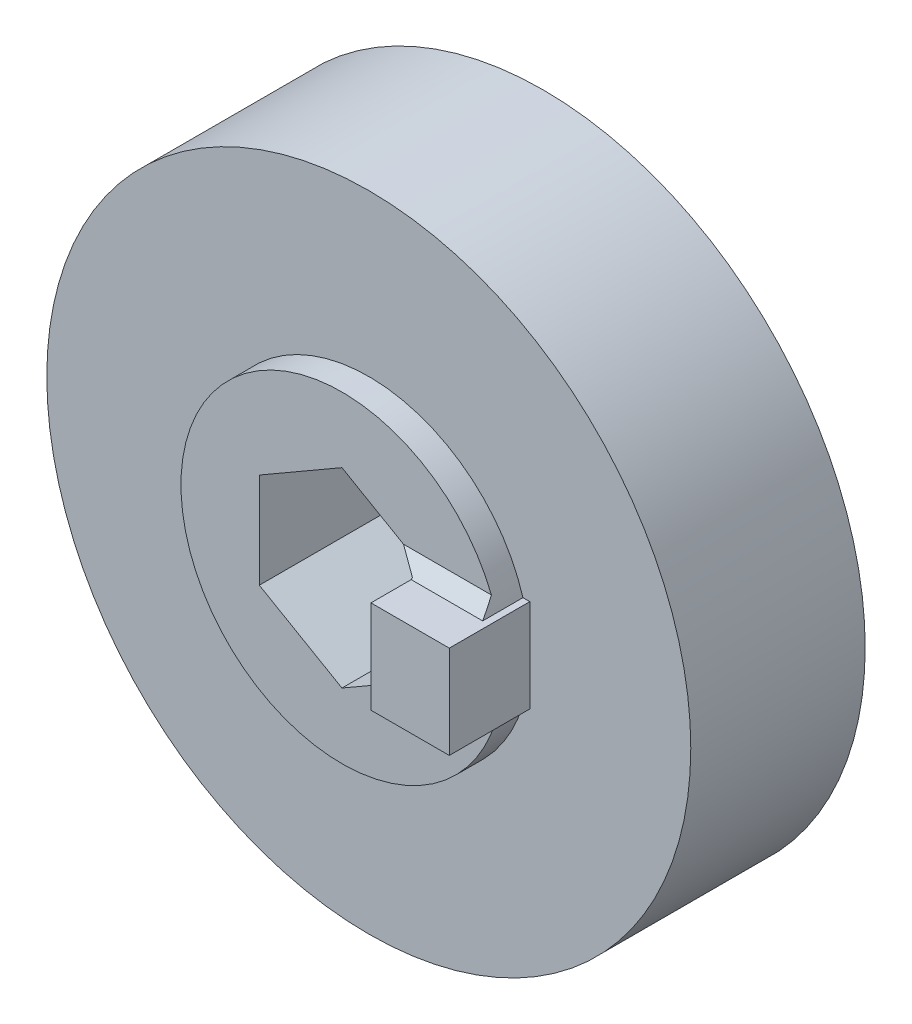
ISO-10303-21;
HEADER;
FILE_DESCRIPTION(('STEP AP214'),'2;1');
FILE_NAME('part.step','',(''),(''),'','','');
FILE_SCHEMA(('AUTOMOTIVE_DESIGN { 1 0 10303 214 1 1 1 1 }'));
ENDSEC;
DATA;
#1=APPLICATION_CONTEXT('core data for automotive mechanical design processes');
#2=APPLICATION_PROTOCOL_DEFINITION('international standard','automotive_design',2000,#1);
#3=PRODUCT_CONTEXT('',#1,'mechanical');
#4=PRODUCT('Part','Part','',(#3));
#5=PRODUCT_RELATED_PRODUCT_CATEGORY('part','',(#4));
#6=PRODUCT_DEFINITION_FORMATION('','',#4);
#7=PRODUCT_DEFINITION_CONTEXT('part definition',#1,'design');
#8=PRODUCT_DEFINITION('design','',#6,#7);
#9=PRODUCT_DEFINITION_SHAPE('','',#8);
#10=(LENGTH_UNIT() NAMED_UNIT(*) SI_UNIT(.MILLI.,.METRE.));
#11=(NAMED_UNIT(*) PLANE_ANGLE_UNIT() SI_UNIT($,.RADIAN.));
#12=(NAMED_UNIT(*) SI_UNIT($,.STERADIAN.) SOLID_ANGLE_UNIT());
#13=UNCERTAINTY_MEASURE_WITH_UNIT(LENGTH_MEASURE(1.E-05),#10,'distance_accuracy_value','');
#14=(GEOMETRIC_REPRESENTATION_CONTEXT(3) GLOBAL_UNCERTAINTY_ASSIGNED_CONTEXT((#13)) GLOBAL_UNIT_ASSIGNED_CONTEXT((#10,
#11,#12)) REPRESENTATION_CONTEXT('',''));
#15=CARTESIAN_POINT('',(0.,0.,0.));
#16=DIRECTION('',(0.,0.,1.));
#17=DIRECTION('',(1.,0.,0.));
#18=AXIS2_PLACEMENT_3D('',#15,#16,#17);
#19=CARTESIAN_POINT('',(3.08,0.,28.8811915483254));
#20=DIRECTION('',(-1.,0.,0.));
#21=DIRECTION('',(0.,0.,1.));
#22=AXIS2_PLACEMENT_3D('',#19,#20,#21);
#23=PLANE('',#22);
#24=DIRECTION('',(0.,0.,-1.));
#25=VECTOR('',#24,1.);
#26=CARTESIAN_POINT('',(3.08,1.77823882910405,28.8811915483254));
#27=LINE('',#26,#25);
#28=CARTESIAN_POINT('',(3.08,1.77823882910405,0.453811978464832));
#29=VERTEX_POINT('',#28);
#30=CARTESIAN_POINT('',(3.08,1.77823882910405,-6.));
#31=VERTEX_POINT('',#30);
#32=EDGE_CURVE('E73',#29,#31,#27,.T.);
#33=ORIENTED_EDGE('',*,*,#32,.T.);
#34=DIRECTION('',(0.,1.,0.));
#35=VECTOR('',#34,1.);
#36=CARTESIAN_POINT('',(3.08,-1.77823882910405,-6.));
#37=LINE('',#36,#35);
#38=CARTESIAN_POINT('',(3.08,-1.77823882910405,-6.));
#39=VERTEX_POINT('',#38);
#40=EDGE_CURVE('E161',#39,#31,#37,.T.);
#41=ORIENTED_EDGE('',*,*,#40,.F.);
#42=DIRECTION('',(0.,0.,1.));
#43=VECTOR('',#42,1.);
#44=CARTESIAN_POINT('',(3.08,-1.77823882910405,-6.));
#45=LINE('',#44,#43);
#46=CARTESIAN_POINT('',(3.08,-1.77823882910405,0.));
#47=VERTEX_POINT('',#46);
#48=EDGE_CURVE('E152',#39,#47,#45,.T.);
#49=ORIENTED_EDGE('',*,*,#48,.T.);
#50=DIRECTION('',(0.,1.,0.));
#51=VECTOR('',#50,1.);
#52=CARTESIAN_POINT('',(3.08,-1.77823882910405,0.));
#53=LINE('',#52,#51);
#54=CARTESIAN_POINT('',(3.08,-1.73205080756887,0.));
#55=VERTEX_POINT('',#54);
#56=EDGE_CURVE('E185',#47,#55,#53,.T.);
#57=ORIENTED_EDGE('',*,*,#56,.T.);
#58=DIRECTION('',(0.,0.,-1.));
#59=VECTOR('',#58,1.);
#60=CARTESIAN_POINT('',(3.08,-1.73205080756887,0.));
#61=LINE('',#60,#59);
#62=CARTESIAN_POINT('',(3.08,-1.73205080756887,2.));
#63=VERTEX_POINT('',#62);
#64=EDGE_CURVE('E236',#63,#55,#61,.T.);
#65=ORIENTED_EDGE('',*,*,#64,.F.);
#66=DIRECTION('',(0.,-1.,0.));
#67=VECTOR('',#66,1.);
#68=CARTESIAN_POINT('',(3.08,-1.73205080756887,2.));
#69=LINE('',#68,#67);
#70=CARTESIAN_POINT('',(3.08,1.73205080756887,2.));
#71=VERTEX_POINT('',#70);
#72=EDGE_CURVE('E205',#71,#63,#69,.T.);
#73=ORIENTED_EDGE('',*,*,#72,.F.);
#74=DIRECTION('',(0.,0.,-1.));
#75=VECTOR('',#74,1.);
#76=CARTESIAN_POINT('',(3.08,1.73205080756887,2.));
#77=LINE('',#76,#75);
#78=CARTESIAN_POINT('',(3.08,1.73205080756887,0.5));
#79=VERTEX_POINT('',#78);
#80=EDGE_CURVE('E208',#71,#79,#77,.T.);
#81=ORIENTED_EDGE('',*,*,#80,.T.);
#82=DIRECTION('',(0.,0.707106781186548,-0.707106781186548));
#83=VECTOR('',#82,1.);
#84=CARTESIAN_POINT('',(3.08,-13.3245703703783,15.5566211779472));
#85=LINE('',#84,#83);
#86=EDGE_CURVE('E244',#29,#79,#85,.F.);
#87=ORIENTED_EDGE('',*,*,#86,.F.);
#88=EDGE_LOOP('',(#33,#41,#49,#57,#65,#73,#81,#87));
#89=FACE_BOUND('',#88,.T.);
#90=ADVANCED_FACE('F49',(#89),#23,.T.);
#91=CARTESIAN_POINT('',(0.,0.,-1.));
#92=DIRECTION('',(0.,0.,1.));
#93=DIRECTION('',(1.,0.,0.));
#94=AXIS2_PLACEMENT_3D('',#91,#92,#93);
#95=CYLINDRICAL_SURFACE('',#94,6.);
#96=DIRECTION('',(0.,0.,1.));
#97=VECTOR('',#96,1.);
#98=CARTESIAN_POINT('',(5.74456264653803,1.73205080756887,-1.));
#99=LINE('',#98,#97);
#100=CARTESIAN_POINT('',(5.74456264653803,1.73205080756887,-1.));
#101=VERTEX_POINT('',#100);
#102=CARTESIAN_POINT('',(5.74456264653803,1.73205080756887,0.5));
#103=VERTEX_POINT('',#102);
#104=EDGE_CURVE('E338',#101,#103,#99,.T.);
#105=ORIENTED_EDGE('',*,*,#104,.F.);
#106=CARTESIAN_POINT('',(0.,0.,-1.));
#107=DIRECTION('',(0.,0.,-1.));
#108=DIRECTION('',(1.,0.,0.));
#109=AXIS2_PLACEMENT_3D('',#106,#107,#108);
#110=CIRCLE('',#109,6.);
#111=CARTESIAN_POINT('',(5.74456264653803,-1.73205080756887,-1.));
#112=VERTEX_POINT('',#111);
#113=EDGE_CURVE('E218',#112,#101,#110,.T.);
#114=ORIENTED_EDGE('',*,*,#113,.F.);
#115=DIRECTION('',(0.,0.,1.));
#116=VECTOR('',#115,1.);
#117=CARTESIAN_POINT('',(5.74456264653803,-1.73205080756887,-1.));
#118=LINE('',#117,#116);
#119=CARTESIAN_POINT('',(5.74456264653803,-1.73205080756887,0.));
#120=VERTEX_POINT('',#119);
#121=EDGE_CURVE('E230',#112,#120,#118,.T.);
#122=ORIENTED_EDGE('',*,*,#121,.T.);
#123=CARTESIAN_POINT('',(0.,0.,0.));
#124=DIRECTION('',(0.,0.,-1.));
#125=DIRECTION('',(1.,0.,0.));
#126=AXIS2_PLACEMENT_3D('',#123,#124,#125);
#127=CIRCLE('',#126,6.);
#128=CARTESIAN_POINT('',(5.56937601463855,2.23205080756887,0.));
#129=VERTEX_POINT('',#128);
#130=EDGE_CURVE('E215',#120,#129,#127,.T.);
#131=ORIENTED_EDGE('',*,*,#130,.T.);
#132=CARTESIAN_POINT('',(0.,0.,2.23205080756888));
#133=DIRECTION('',(0.,0.707106781186548,0.707106781186548));
#134=DIRECTION('',(0.,-0.707106781186548,0.707106781186548));
#135=AXIS2_PLACEMENT_3D('',#132,#133,#134);
#136=ELLIPSE('',#135,8.48528137423857,6.);
#137=EDGE_CURVE('E58',#129,#103,#136,.F.);
#138=ORIENTED_EDGE('',*,*,#137,.T.);
#139=EDGE_LOOP('',(#105,#114,#122,#131,#138));
#140=FACE_BOUND('',#139,.T.);
#141=ADVANCED_FACE('F51',(#140),#95,.T.);
#142=CARTESIAN_POINT('',(1.54,2.66735824365607,28.8811915483254));
#143=DIRECTION('',(-0.5,-0.866025403784439,0.));
#144=DIRECTION('',(0.866025403784439,-0.5,0.));
#145=AXIS2_PLACEMENT_3D('',#142,#143,#144);
#146=PLANE('',#145);
#147=DIRECTION('',(0.774596669241483,-0.447213595499958,0.447213595499958));
#148=VECTOR('',#147,1.);
#149=CARTESIAN_POINT('',(3.964,1.26786119114042,0.96418961642846));
#150=LINE('',#149,#148);
#151=CARTESIAN_POINT('',(2.29397459621557,2.23205080756887,0.));
#152=VERTEX_POINT('',#151);
#153=EDGE_CURVE('E247',#29,#152,#150,.F.);
#154=ORIENTED_EDGE('',*,*,#153,.T.);
#155=DIRECTION('',(-0.866025403784439,0.5,0.));
#156=VECTOR('',#155,1.);
#157=CARTESIAN_POINT('',(1.54,2.66735824365607,0.));
#158=LINE('',#157,#156);
#159=CARTESIAN_POINT('',(0.,3.55647765820809,0.));
#160=VERTEX_POINT('',#159);
#161=EDGE_CURVE('E12',#152,#160,#158,.T.);
#162=ORIENTED_EDGE('',*,*,#161,.T.);
#163=DIRECTION('',(0.,0.,1.));
#164=VECTOR('',#163,1.);
#165=CARTESIAN_POINT('',(0.,3.55647765820809,-6.));
#166=LINE('',#165,#164);
#167=CARTESIAN_POINT('',(0.,3.55647765820809,-6.));
#168=VERTEX_POINT('',#167);
#169=EDGE_CURVE('E194',#168,#160,#166,.T.);
#170=ORIENTED_EDGE('',*,*,#169,.F.);
#171=DIRECTION('',(-0.866025403784439,0.5,0.));
#172=VECTOR('',#171,1.);
#173=CARTESIAN_POINT('',(3.08,1.77823882910405,-6.));
#174=LINE('',#173,#172);
#175=EDGE_CURVE('E176',#31,#168,#174,.T.);
#176=ORIENTED_EDGE('',*,*,#175,.F.);
#177=ORIENTED_EDGE('',*,*,#32,.F.);
#178=EDGE_LOOP('',(#154,#162,#170,#176,#177));
#179=FACE_BOUND('',#178,.T.);
#180=ADVANCED_FACE('F607',(#179),#146,.T.);
#181=CARTESIAN_POINT('',(4.5,1.73205080756887,0.5));
#182=DIRECTION('',(0.,0.707106781186548,0.707106781186548));
#183=DIRECTION('',(1.,0.,0.));
#184=AXIS2_PLACEMENT_3D('',#181,#182,#183);
#185=PLANE('',#184);
#186=DIRECTION('',(1.,0.,0.));
#187=VECTOR('',#186,1.);
#188=CARTESIAN_POINT('',(5.74456264653803,2.23205080756887,0.));
#189=LINE('',#188,#187);
#190=EDGE_CURVE('E253',#152,#129,#189,.T.);
#191=ORIENTED_EDGE('',*,*,#190,.F.);
#192=ORIENTED_EDGE('',*,*,#153,.F.);
#193=ORIENTED_EDGE('',*,*,#86,.T.);
#194=DIRECTION('',(-1.,0.,0.));
#195=VECTOR('',#194,1.);
#196=CARTESIAN_POINT('',(3.,1.73205080756887,0.5));
#197=LINE('',#196,#195);
#198=EDGE_CURVE('E242',#103,#79,#197,.T.);
#199=ORIENTED_EDGE('',*,*,#198,.F.);
#200=ORIENTED_EDGE('',*,*,#137,.F.);
#201=EDGE_LOOP('',(#191,#192,#193,#199,#200));
#202=FACE_BOUND('',#201,.T.);
#203=ADVANCED_FACE('F583',(#202),#185,.T.);
#204=CARTESIAN_POINT('',(6.,-1.73205080756887,0.5));
#205=DIRECTION('',(-1.,0.,0.));
#206=DIRECTION('',(0.,0.,1.));
#207=AXIS2_PLACEMENT_3D('',#204,#205,#206);
#208=PLANE('',#207);
#209=DIRECTION('',(0.,0.,1.));
#210=VECTOR('',#209,1.);
#211=CARTESIAN_POINT('',(6.,1.73205080756887,0.5));
#212=LINE('',#211,#210);
#213=CARTESIAN_POINT('',(6.,1.73205080756887,-1.));
#214=VERTEX_POINT('',#213);
#215=CARTESIAN_POINT('',(6.,1.73205080756887,2.));
#216=VERTEX_POINT('',#215);
#217=EDGE_CURVE('E233',#214,#216,#212,.T.);
#218=ORIENTED_EDGE('',*,*,#217,.T.);
#219=DIRECTION('',(0.,1.,0.));
#220=VECTOR('',#219,1.);
#221=CARTESIAN_POINT('',(6.,1.73205080756887,2.));
#222=LINE('',#221,#220);
#223=CARTESIAN_POINT('',(6.,-1.73205080756887,2.));
#224=VERTEX_POINT('',#223);
#225=EDGE_CURVE('E200',#224,#216,#222,.T.);
#226=ORIENTED_EDGE('',*,*,#225,.F.);
#227=DIRECTION('',(0.,0.,1.));
#228=VECTOR('',#227,1.);
#229=CARTESIAN_POINT('',(6.,-1.73205080756887,0.5));
#230=LINE('',#229,#228);
#231=CARTESIAN_POINT('',(6.,-1.73205080756887,-1.));
#232=VERTEX_POINT('',#231);
#233=EDGE_CURVE('E234',#232,#224,#230,.T.);
#234=ORIENTED_EDGE('',*,*,#233,.F.);
#235=DIRECTION('',(0.,-1.,0.));
#236=VECTOR('',#235,1.);
#237=CARTESIAN_POINT('',(6.,-1.73205080756887,-1.));
#238=LINE('',#237,#236);
#239=EDGE_CURVE('E224',#214,#232,#238,.T.);
#240=ORIENTED_EDGE('',*,*,#239,.F.);
#241=EDGE_LOOP('',(#218,#226,#234,#240));
#242=FACE_BOUND('',#241,.T.);
#243=ADVANCED_FACE('F606',(#242),#208,.F.);
#244=CARTESIAN_POINT('',(0.,-1.73205080756887,0.));
#245=DIRECTION('',(0.,1.,0.));
#246=DIRECTION('',(0.,0.,1.));
#247=AXIS2_PLACEMENT_3D('',#244,#245,#246);
#248=PLANE('',#247);
#249=ORIENTED_EDGE('',*,*,#233,.T.);
#250=DIRECTION('',(1.,0.,0.));
#251=VECTOR('',#250,1.);
#252=CARTESIAN_POINT('',(6.,-1.73205080756887,2.));
#253=LINE('',#252,#251);
#254=EDGE_CURVE('E191',#63,#224,#253,.T.);
#255=ORIENTED_EDGE('',*,*,#254,.F.);
#256=ORIENTED_EDGE('',*,*,#64,.T.);
#257=DIRECTION('',(1.,0.,0.));
#258=VECTOR('',#257,1.);
#259=CARTESIAN_POINT('',(6.,-1.73205080756887,0.));
#260=LINE('',#259,#258);
#261=EDGE_CURVE('E239',#55,#120,#260,.T.);
#262=ORIENTED_EDGE('',*,*,#261,.T.);
#263=ORIENTED_EDGE('',*,*,#121,.F.);
#264=DIRECTION('',(-1.,0.,0.));
#265=VECTOR('',#264,1.);
#266=CARTESIAN_POINT('',(5.74456264653803,-1.73205080756887,-1.));
#267=LINE('',#266,#265);
#268=EDGE_CURVE('E227',#232,#112,#267,.T.);
#269=ORIENTED_EDGE('',*,*,#268,.F.);
#270=EDGE_LOOP('',(#249,#255,#256,#262,#263,#269));
#271=FACE_BOUND('',#270,.T.);
#272=ADVANCED_FACE('F665',(#271),#248,.F.);
#273=CARTESIAN_POINT('',(0.,1.73205080756887,0.));
#274=DIRECTION('',(0.,1.,0.));
#275=DIRECTION('',(0.,0.,1.));
#276=AXIS2_PLACEMENT_3D('',#273,#274,#275);
#277=PLANE('',#276);
#278=ORIENTED_EDGE('',*,*,#217,.F.);
#279=DIRECTION('',(1.,0.,0.));
#280=VECTOR('',#279,1.);
#281=CARTESIAN_POINT('',(6.,1.73205080756887,-1.));
#282=LINE('',#281,#280);
#283=EDGE_CURVE('E221',#101,#214,#282,.T.);
#284=ORIENTED_EDGE('',*,*,#283,.F.);
#285=ORIENTED_EDGE('',*,*,#104,.T.);
#286=ORIENTED_EDGE('',*,*,#198,.T.);
#287=ORIENTED_EDGE('',*,*,#80,.F.);
#288=DIRECTION('',(-1.,0.,0.));
#289=VECTOR('',#288,1.);
#290=CARTESIAN_POINT('',(3.08,1.73205080756887,2.));
#291=LINE('',#290,#289);
#292=EDGE_CURVE('E203',#216,#71,#291,.T.);
#293=ORIENTED_EDGE('',*,*,#292,.F.);
#294=EDGE_LOOP('',(#278,#284,#285,#286,#287,#293));
#295=FACE_BOUND('',#294,.T.);
#296=ADVANCED_FACE('F675',(#295),#277,.T.);
#297=CARTESIAN_POINT('',(0.,0.,0.));
#298=DIRECTION('',(0.,0.,1.));
#299=DIRECTION('',(1.,0.,0.));
#300=AXIS2_PLACEMENT_3D('',#297,#298,#299);
#301=PLANE('',#300);
#302=ORIENTED_EDGE('',*,*,#161,.F.);
#303=ORIENTED_EDGE('',*,*,#190,.T.);
#304=ORIENTED_EDGE('',*,*,#130,.F.);
#305=ORIENTED_EDGE('',*,*,#261,.F.);
#306=ORIENTED_EDGE('',*,*,#56,.F.);
#307=DIRECTION('',(0.866025403784438,0.500000000000001,0.));
#308=VECTOR('',#307,1.);
#309=CARTESIAN_POINT('',(0.,-3.55647765820809,0.));
#310=LINE('',#309,#308);
#311=CARTESIAN_POINT('',(0.,-3.55647765820809,0.));
#312=VERTEX_POINT('',#311);
#313=EDGE_CURVE('E183',#312,#47,#310,.T.);
#314=ORIENTED_EDGE('',*,*,#313,.F.);
#315=DIRECTION('',(0.866025403784438,-0.500000000000001,0.));
#316=VECTOR('',#315,1.);
#317=CARTESIAN_POINT('',(-3.08,-1.77823882910405,0.));
#318=LINE('',#317,#316);
#319=CARTESIAN_POINT('',(-3.08,-1.77823882910405,0.));
#320=VERTEX_POINT('',#319);
#321=EDGE_CURVE('E65',#320,#312,#318,.T.);
#322=ORIENTED_EDGE('',*,*,#321,.F.);
#323=DIRECTION('',(0.,-1.,0.));
#324=VECTOR('',#323,1.);
#325=CARTESIAN_POINT('',(-3.08,1.77823882910405,0.));
#326=LINE('',#325,#324);
#327=CARTESIAN_POINT('',(-3.08,1.77823882910405,0.));
#328=VERTEX_POINT('',#327);
#329=EDGE_CURVE('E166',#328,#320,#326,.T.);
#330=ORIENTED_EDGE('',*,*,#329,.F.);
#331=DIRECTION('',(-0.866025403784439,-0.5,0.));
#332=VECTOR('',#331,1.);
#333=CARTESIAN_POINT('',(0.,3.55647765820809,0.));
#334=LINE('',#333,#332);
#335=EDGE_CURVE('E169',#160,#328,#334,.T.);
#336=ORIENTED_EDGE('',*,*,#335,.F.);
#337=EDGE_LOOP('',(#302,#303,#304,#305,#306,#314,#322,#330,#336));
#338=FACE_BOUND('',#337,.T.);
#339=ADVANCED_FACE('F578',(#338),#301,.T.);
#340=CARTESIAN_POINT('',(0.,0.,-1.));
#341=DIRECTION('',(0.,0.,-1.));
#342=DIRECTION('',(-1.,0.,0.));
#343=AXIS2_PLACEMENT_3D('',#340,#341,#342);
#344=PLANE('',#343);
#345=CARTESIAN_POINT('',(0.,0.,-1.));
#346=DIRECTION('',(0.,0.,1.));
#347=DIRECTION('',(-1.,0.,0.));
#348=AXIS2_PLACEMENT_3D('',#345,#346,#347);
#349=CIRCLE('',#348,12.);
#350=CARTESIAN_POINT('',(-12.,0.,-1.));
#351=VERTEX_POINT('',#350);
#352=EDGE_CURVE('E211',#351,#351,#349,.T.);
#353=ORIENTED_EDGE('',*,*,#352,.T.);
#354=EDGE_LOOP('',(#353));
#355=FACE_BOUND('',#354,.T.);
#356=ORIENTED_EDGE('',*,*,#268,.T.);
#357=ORIENTED_EDGE('',*,*,#113,.T.);
#358=ORIENTED_EDGE('',*,*,#283,.T.);
#359=ORIENTED_EDGE('',*,*,#239,.T.);
#360=EDGE_LOOP('',(#356,#357,#358,#359));
#361=FACE_BOUND('',#360,.T.);
#362=ADVANCED_FACE('F693',(#355,#361),#344,.F.);
#363=CARTESIAN_POINT('',(0.,0.,-7.5));
#364=DIRECTION('',(0.,0.,1.));
#365=DIRECTION('',(1.,0.,0.));
#366=AXIS2_PLACEMENT_3D('',#363,#364,#365);
#367=CYLINDRICAL_SURFACE('',#366,12.);
#368=CARTESIAN_POINT('',(0.,0.,-7.5));
#369=DIRECTION('',(0.,0.,1.));
#370=DIRECTION('',(-1.,0.,0.));
#371=AXIS2_PLACEMENT_3D('',#368,#369,#370);
#372=CIRCLE('',#371,12.);
#373=CARTESIAN_POINT('',(-12.,0.,-7.5));
#374=VERTEX_POINT('',#373);
#375=EDGE_CURVE('E212',#374,#374,#372,.T.);
#376=ORIENTED_EDGE('',*,*,#375,.T.);
#377=EDGE_LOOP('',(#376));
#378=FACE_BOUND('',#377,.T.);
#379=ORIENTED_EDGE('',*,*,#352,.F.);
#380=EDGE_LOOP('',(#379));
#381=FACE_BOUND('',#380,.T.);
#382=ADVANCED_FACE('F702',(#378,#381),#367,.T.);
#383=CARTESIAN_POINT('',(0.,0.,-7.5));
#384=DIRECTION('',(0.,0.,-1.));
#385=DIRECTION('',(-1.,0.,0.));
#386=AXIS2_PLACEMENT_3D('',#383,#384,#385);
#387=PLANE('',#386);
#388=CARTESIAN_POINT('',(-6.,0.,-7.5));
#389=DIRECTION('',(0.,0.,-1.));
#390=DIRECTION('',(-1.,0.,0.));
#391=AXIS2_PLACEMENT_3D('',#388,#389,#390);
#392=CIRCLE('',#391,2.8);
#393=CARTESIAN_POINT('',(-8.8,0.,-7.5));
#394=VERTEX_POINT('',#393);
#395=EDGE_CURVE('E901',#394,#394,#392,.T.);
#396=ORIENTED_EDGE('',*,*,#395,.F.);
#397=EDGE_LOOP('',(#396));
#398=FACE_BOUND('',#397,.T.);
#399=CARTESIAN_POINT('',(6.,0.,-7.5));
#400=DIRECTION('',(0.,0.,-1.));
#401=DIRECTION('',(-1.,0.,0.));
#402=AXIS2_PLACEMENT_3D('',#399,#400,#401);
#403=CIRCLE('',#402,2.8);
#404=CARTESIAN_POINT('',(3.2,0.,-7.5));
#405=VERTEX_POINT('',#404);
#406=EDGE_CURVE('E908',#405,#405,#403,.T.);
#407=ORIENTED_EDGE('',*,*,#406,.F.);
#408=EDGE_LOOP('',(#407));
#409=FACE_BOUND('',#408,.T.);
#410=CARTESIAN_POINT('',(0.,0.,-7.5));
#411=DIRECTION('',(0.,0.,-1.));
#412=DIRECTION('',(-1.,0.,0.));
#413=AXIS2_PLACEMENT_3D('',#410,#411,#412);
#414=CIRCLE('',#413,2.1);
#415=CARTESIAN_POINT('',(-2.1,0.,-7.5));
#416=VERTEX_POINT('',#415);
#417=EDGE_CURVE('E172',#416,#416,#414,.T.);
#418=ORIENTED_EDGE('',*,*,#417,.F.);
#419=EDGE_LOOP('',(#418));
#420=FACE_BOUND('',#419,.T.);
#421=ORIENTED_EDGE('',*,*,#375,.F.);
#422=EDGE_LOOP('',(#421));
#423=FACE_BOUND('',#422,.T.);
#424=ADVANCED_FACE('F712',(#398,#409,#420,#423),#387,.T.);
#425=CARTESIAN_POINT('',(0.,0.,2.));
#426=DIRECTION('',(0.,0.,-1.));
#427=DIRECTION('',(-1.,0.,0.));
#428=AXIS2_PLACEMENT_3D('',#425,#426,#427);
#429=PLANE('',#428);
#430=ORIENTED_EDGE('',*,*,#254,.T.);
#431=ORIENTED_EDGE('',*,*,#225,.T.);
#432=ORIENTED_EDGE('',*,*,#292,.T.);
#433=ORIENTED_EDGE('',*,*,#72,.T.);
#434=EDGE_LOOP('',(#430,#431,#432,#433));
#435=FACE_BOUND('',#434,.T.);
#436=ADVANCED_FACE('F722',(#435),#429,.F.);
#437=CARTESIAN_POINT('',(-3.08,-1.77823882910405,-6.));
#438=DIRECTION('',(-0.500000000000001,-0.866025403784438,0.));
#439=DIRECTION('',(0.866025403784438,-0.500000000000001,0.));
#440=AXIS2_PLACEMENT_3D('',#437,#438,#439);
#441=PLANE('',#440);
#442=ORIENTED_EDGE('',*,*,#321,.T.);
#443=DIRECTION('',(0.,0.,1.));
#444=VECTOR('',#443,1.);
#445=CARTESIAN_POINT('',(0.,-3.55647765820809,-6.));
#446=LINE('',#445,#444);
#447=CARTESIAN_POINT('',(0.,-3.55647765820809,-6.));
#448=VERTEX_POINT('',#447);
#449=EDGE_CURVE('E143',#448,#312,#446,.T.);
#450=ORIENTED_EDGE('',*,*,#449,.F.);
#451=DIRECTION('',(0.866025403784438,-0.500000000000001,0.));
#452=VECTOR('',#451,1.);
#453=CARTESIAN_POINT('',(-3.08,-1.77823882910405,-6.));
#454=LINE('',#453,#452);
#455=CARTESIAN_POINT('',(-3.08,-1.77823882910405,-6.));
#456=VERTEX_POINT('',#455);
#457=EDGE_CURVE('E147',#456,#448,#454,.T.);
#458=ORIENTED_EDGE('',*,*,#457,.F.);
#459=DIRECTION('',(0.,0.,1.));
#460=VECTOR('',#459,1.);
#461=CARTESIAN_POINT('',(-3.08,-1.77823882910405,-6.));
#462=LINE('',#461,#460);
#463=EDGE_CURVE('E189',#456,#320,#462,.T.);
#464=ORIENTED_EDGE('',*,*,#463,.T.);
#465=EDGE_LOOP('',(#442,#450,#458,#464));
#466=FACE_BOUND('',#465,.T.);
#467=ADVANCED_FACE('F145',(#466),#441,.F.);
#468=CARTESIAN_POINT('',(-3.08,1.77823882910405,-6.));
#469=DIRECTION('',(-1.,0.,0.));
#470=DIRECTION('',(0.,0.,1.));
#471=AXIS2_PLACEMENT_3D('',#468,#469,#470);
#472=PLANE('',#471);
#473=ORIENTED_EDGE('',*,*,#329,.T.);
#474=ORIENTED_EDGE('',*,*,#463,.F.);
#475=DIRECTION('',(0.,-1.,0.));
#476=VECTOR('',#475,1.);
#477=CARTESIAN_POINT('',(-3.08,1.77823882910405,-6.));
#478=LINE('',#477,#476);
#479=CARTESIAN_POINT('',(-3.08,1.77823882910405,-6.));
#480=VERTEX_POINT('',#479);
#481=EDGE_CURVE('E153',#480,#456,#478,.T.);
#482=ORIENTED_EDGE('',*,*,#481,.F.);
#483=DIRECTION('',(0.,0.,1.));
#484=VECTOR('',#483,1.);
#485=CARTESIAN_POINT('',(-3.08,1.77823882910405,-6.));
#486=LINE('',#485,#484);
#487=EDGE_CURVE('E192',#480,#328,#486,.T.);
#488=ORIENTED_EDGE('',*,*,#487,.T.);
#489=EDGE_LOOP('',(#473,#474,#482,#488));
#490=FACE_BOUND('',#489,.T.);
#491=ADVANCED_FACE('F741',(#490),#472,.F.);
#492=CARTESIAN_POINT('',(0.,3.55647765820809,-6.));
#493=DIRECTION('',(-0.5,0.866025403784439,0.));
#494=DIRECTION('',(-0.866025403784439,-0.5,0.));
#495=AXIS2_PLACEMENT_3D('',#492,#493,#494);
#496=PLANE('',#495);
#497=ORIENTED_EDGE('',*,*,#335,.T.);
#498=ORIENTED_EDGE('',*,*,#487,.F.);
#499=DIRECTION('',(-0.866025403784439,-0.5,0.));
#500=VECTOR('',#499,1.);
#501=CARTESIAN_POINT('',(0.,3.55647765820809,-6.));
#502=LINE('',#501,#500);
#503=EDGE_CURVE('E179',#168,#480,#502,.T.);
#504=ORIENTED_EDGE('',*,*,#503,.F.);
#505=ORIENTED_EDGE('',*,*,#169,.T.);
#506=EDGE_LOOP('',(#497,#498,#504,#505));
#507=FACE_BOUND('',#506,.T.);
#508=ADVANCED_FACE('F750',(#507),#496,.F.);
#509=CARTESIAN_POINT('',(0.,-3.55647765820809,-6.));
#510=DIRECTION('',(0.500000000000001,-0.866025403784438,0.));
#511=DIRECTION('',(0.866025403784438,0.500000000000001,0.));
#512=AXIS2_PLACEMENT_3D('',#509,#510,#511);
#513=PLANE('',#512);
#514=ORIENTED_EDGE('',*,*,#313,.T.);
#515=ORIENTED_EDGE('',*,*,#48,.F.);
#516=DIRECTION('',(0.866025403784438,0.500000000000001,0.));
#517=VECTOR('',#516,1.);
#518=CARTESIAN_POINT('',(0.,-3.55647765820809,-6.));
#519=LINE('',#518,#517);
#520=EDGE_CURVE('E156',#448,#39,#519,.T.);
#521=ORIENTED_EDGE('',*,*,#520,.F.);
#522=ORIENTED_EDGE('',*,*,#449,.T.);
#523=EDGE_LOOP('',(#514,#515,#521,#522));
#524=FACE_BOUND('',#523,.T.);
#525=ADVANCED_FACE('F157',(#524),#513,.F.);
#526=CARTESIAN_POINT('',(0.,0.,-6.));
#527=DIRECTION('',(0.,0.,1.));
#528=DIRECTION('',(1.,0.,0.));
#529=AXIS2_PLACEMENT_3D('',#526,#527,#528);
#530=PLANE('',#529);
#531=CARTESIAN_POINT('',(0.,0.,-6.));
#532=DIRECTION('',(0.,0.,1.));
#533=DIRECTION('',(1.,0.,0.));
#534=AXIS2_PLACEMENT_3D('',#531,#532,#533);
#535=CIRCLE('',#534,2.1);
#536=CARTESIAN_POINT('',(2.1,0.,-6.));
#537=VERTEX_POINT('',#536);
#538=EDGE_CURVE('E53',#537,#537,#535,.T.);
#539=ORIENTED_EDGE('',*,*,#538,.F.);
#540=EDGE_LOOP('',(#539));
#541=FACE_BOUND('',#540,.T.);
#542=ORIENTED_EDGE('',*,*,#457,.T.);
#543=ORIENTED_EDGE('',*,*,#520,.T.);
#544=ORIENTED_EDGE('',*,*,#40,.T.);
#545=ORIENTED_EDGE('',*,*,#175,.T.);
#546=ORIENTED_EDGE('',*,*,#503,.T.);
#547=ORIENTED_EDGE('',*,*,#481,.T.);
#548=EDGE_LOOP('',(#542,#543,#544,#545,#546,#547));
#549=FACE_BOUND('',#548,.T.);
#550=ADVANCED_FACE('F163',(#541,#549),#530,.T.);
#551=CARTESIAN_POINT('',(0.,0.,-2.5));
#552=DIRECTION('',(0.,0.,-1.));
#553=DIRECTION('',(-1.,0.,0.));
#554=AXIS2_PLACEMENT_3D('',#551,#552,#553);
#555=CYLINDRICAL_SURFACE('',#554,2.1);
#556=ORIENTED_EDGE('',*,*,#538,.T.);
#557=EDGE_LOOP('',(#556));
#558=FACE_BOUND('',#557,.T.);
#559=ORIENTED_EDGE('',*,*,#417,.T.);
#560=EDGE_LOOP('',(#559));
#561=FACE_BOUND('',#560,.T.);
#562=ADVANCED_FACE('F777',(#558,#561),#555,.F.);
#563=CARTESIAN_POINT('',(6.,0.,-2.5));
#564=DIRECTION('',(0.,0.,-1.));
#565=DIRECTION('',(-1.,0.,0.));
#566=AXIS2_PLACEMENT_3D('',#563,#564,#565);
#567=CYLINDRICAL_SURFACE('',#566,2.8);
#568=CARTESIAN_POINT('',(6.,0.,-2.5));
#569=DIRECTION('',(0.,0.,-1.));
#570=DIRECTION('',(-1.,0.,0.));
#571=AXIS2_PLACEMENT_3D('',#568,#569,#570);
#572=CIRCLE('',#571,2.8);
#573=CARTESIAN_POINT('',(3.2,0.,-2.5));
#574=VERTEX_POINT('',#573);
#575=EDGE_CURVE('E903',#574,#574,#572,.T.);
#576=ORIENTED_EDGE('',*,*,#575,.F.);
#577=EDGE_LOOP('',(#576));
#578=FACE_BOUND('',#577,.T.);
#579=ORIENTED_EDGE('',*,*,#406,.T.);
#580=EDGE_LOOP('',(#579));
#581=FACE_BOUND('',#580,.T.);
#582=ADVANCED_FACE('F787',(#578,#581),#567,.F.);
#583=CARTESIAN_POINT('',(6.,0.,-2.5));
#584=DIRECTION('',(0.,0.,-1.));
#585=DIRECTION('',(-1.,0.,0.));
#586=AXIS2_PLACEMENT_3D('',#583,#584,#585);
#587=PLANE('',#586);
#588=ORIENTED_EDGE('',*,*,#575,.T.);
#589=EDGE_LOOP('',(#588));
#590=FACE_BOUND('',#589,.T.);
#591=ADVANCED_FACE('F797',(#590),#587,.T.);
#592=CARTESIAN_POINT('',(-6.,0.,-2.5));
#593=DIRECTION('',(0.,0.,-1.));
#594=DIRECTION('',(-1.,0.,0.));
#595=AXIS2_PLACEMENT_3D('',#592,#593,#594);
#596=CYLINDRICAL_SURFACE('',#595,2.8);
#597=CARTESIAN_POINT('',(-6.,0.,-2.5));
#598=DIRECTION('',(0.,0.,-1.));
#599=DIRECTION('',(-1.,0.,0.));
#600=AXIS2_PLACEMENT_3D('',#597,#598,#599);
#601=CIRCLE('',#600,2.8);
#602=CARTESIAN_POINT('',(-8.8,0.,-2.5));
#603=VERTEX_POINT('',#602);
#604=EDGE_CURVE('E900',#603,#603,#601,.T.);
#605=ORIENTED_EDGE('',*,*,#604,.F.);
#606=EDGE_LOOP('',(#605));
#607=FACE_BOUND('',#606,.T.);
#608=ORIENTED_EDGE('',*,*,#395,.T.);
#609=EDGE_LOOP('',(#608));
#610=FACE_BOUND('',#609,.T.);
#611=ADVANCED_FACE('F807',(#607,#610),#596,.F.);
#612=CARTESIAN_POINT('',(-6.,0.,-2.5));
#613=DIRECTION('',(0.,0.,-1.));
#614=DIRECTION('',(-1.,0.,0.));
#615=AXIS2_PLACEMENT_3D('',#612,#613,#614);
#616=PLANE('',#615);
#617=ORIENTED_EDGE('',*,*,#604,.T.);
#618=EDGE_LOOP('',(#617));
#619=FACE_BOUND('',#618,.T.);
#620=ADVANCED_FACE('F817',(#619),#616,.T.);
#621=CLOSED_SHELL('',(#90,#141,#180,#203,#243,#272,#296,#339,#362,#382,#424,#436,#467,#491,#508,
#525,#550,#562,#582,#591,#611,#620));
#622=MANIFOLD_SOLID_BREP('B2',#621);
#623=ADVANCED_BREP_SHAPE_REPRESENTATION('',(#18,#622),#14);
#624=SHAPE_DEFINITION_REPRESENTATION(#9,#623);
ENDSEC;
END-ISO-10303-21;
